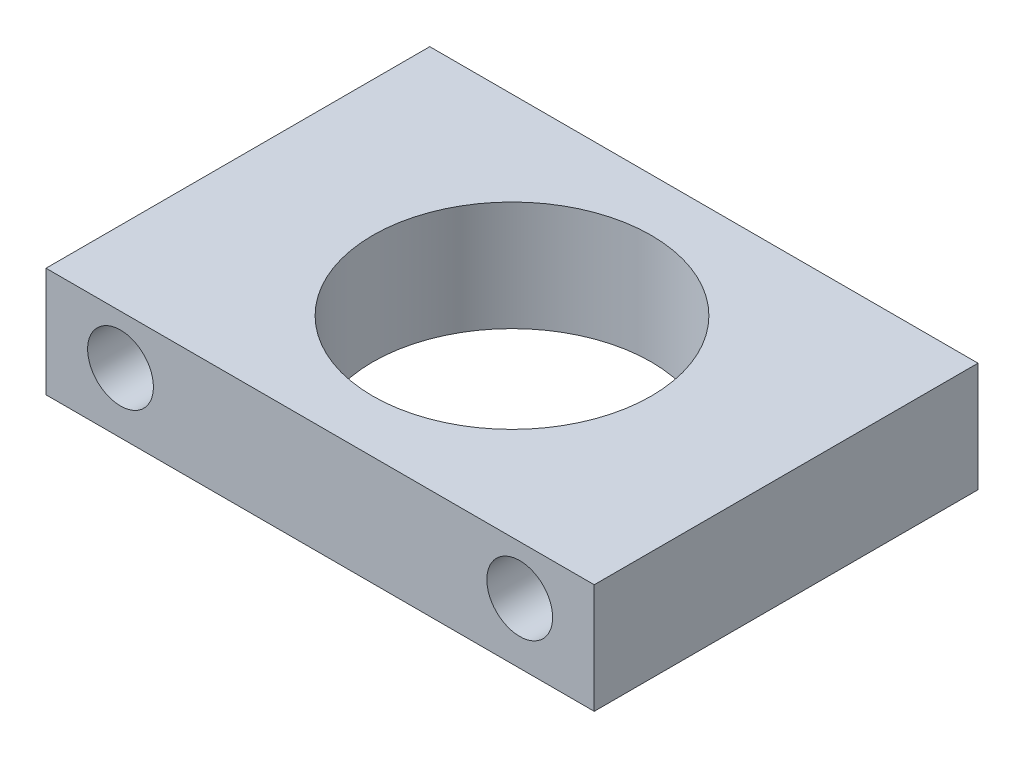
ISO-10303-21;
HEADER;
FILE_DESCRIPTION(('STEP AP214'),'2;1');
FILE_NAME('part.step','',(''),(''),'','','');
FILE_SCHEMA(('AUTOMOTIVE_DESIGN { 1 0 10303 214 1 1 1 1 }'));
ENDSEC;
DATA;
#1=APPLICATION_CONTEXT('core data for automotive mechanical design processes');
#2=APPLICATION_PROTOCOL_DEFINITION('international standard','automotive_design',2000,#1);
#3=PRODUCT_CONTEXT('',#1,'mechanical');
#4=PRODUCT('Part','Part','',(#3));
#5=PRODUCT_RELATED_PRODUCT_CATEGORY('part','',(#4));
#6=PRODUCT_DEFINITION_FORMATION('','',#4);
#7=PRODUCT_DEFINITION_CONTEXT('part definition',#1,'design');
#8=PRODUCT_DEFINITION('design','',#6,#7);
#9=PRODUCT_DEFINITION_SHAPE('','',#8);
#10=(LENGTH_UNIT() NAMED_UNIT(*) SI_UNIT(.MILLI.,.METRE.));
#11=(NAMED_UNIT(*) PLANE_ANGLE_UNIT() SI_UNIT($,.RADIAN.));
#12=(NAMED_UNIT(*) SI_UNIT($,.STERADIAN.) SOLID_ANGLE_UNIT());
#13=UNCERTAINTY_MEASURE_WITH_UNIT(LENGTH_MEASURE(1.E-05),#10,'distance_accuracy_value','');
#14=(GEOMETRIC_REPRESENTATION_CONTEXT(3) GLOBAL_UNCERTAINTY_ASSIGNED_CONTEXT((#13)) GLOBAL_UNIT_ASSIGNED_CONTEXT((#10,
#11,#12)) REPRESENTATION_CONTEXT('',''));
#15=CARTESIAN_POINT('',(0.,0.,0.));
#16=DIRECTION('',(0.,0.,1.));
#17=DIRECTION('',(1.,0.,0.));
#18=AXIS2_PLACEMENT_3D('',#15,#16,#17);
#19=CARTESIAN_POINT('',(0.,10.,0.));
#20=DIRECTION('',(0.,1.,0.));
#21=DIRECTION('',(0.,0.,1.));
#22=AXIS2_PLACEMENT_3D('',#19,#20,#21);
#23=PLANE('',#22);
#24=DIRECTION('',(0.,0.,-1.));
#25=VECTOR('',#24,1.);
#26=CARTESIAN_POINT('',(25.,10.,-17.5));
#27=LINE('',#26,#25);
#28=CARTESIAN_POINT('',(25.,10.,17.5));
#29=VERTEX_POINT('',#28);
#30=CARTESIAN_POINT('',(25.,10.,-17.5));
#31=VERTEX_POINT('',#30);
#32=EDGE_CURVE('E100',#29,#31,#27,.T.);
#33=ORIENTED_EDGE('',*,*,#32,.T.);
#34=DIRECTION('',(-1.,0.,0.));
#35=VECTOR('',#34,1.);
#36=CARTESIAN_POINT('',(-25.,10.,-17.5));
#37=LINE('',#36,#35);
#38=CARTESIAN_POINT('',(-25.,10.,-17.5));
#39=VERTEX_POINT('',#38);
#40=EDGE_CURVE('E95',#31,#39,#37,.T.);
#41=ORIENTED_EDGE('',*,*,#40,.T.);
#42=DIRECTION('',(0.,0.,1.));
#43=VECTOR('',#42,1.);
#44=CARTESIAN_POINT('',(-25.,10.,-17.5));
#45=LINE('',#44,#43);
#46=CARTESIAN_POINT('',(-25.,10.,17.5));
#47=VERTEX_POINT('',#46);
#48=EDGE_CURVE('E98',#39,#47,#45,.T.);
#49=ORIENTED_EDGE('',*,*,#48,.T.);
#50=DIRECTION('',(1.,0.,0.));
#51=VECTOR('',#50,1.);
#52=CARTESIAN_POINT('',(-25.,10.,17.5));
#53=LINE('',#52,#51);
#54=EDGE_CURVE('E59',#47,#29,#53,.T.);
#55=ORIENTED_EDGE('',*,*,#54,.T.);
#56=EDGE_LOOP('',(#33,#41,#49,#55));
#57=FACE_BOUND('',#56,.T.);
#58=CARTESIAN_POINT('',(0.,10.,0.));
#59=DIRECTION('',(0.,1.,0.));
#60=DIRECTION('',(0.,0.,1.));
#61=AXIS2_PLACEMENT_3D('',#58,#59,#60);
#62=CIRCLE('',#61,12.7);
#63=CARTESIAN_POINT('',(0.,10.,12.7));
#64=VERTEX_POINT('',#63);
#65=EDGE_CURVE('E121',#64,#64,#62,.T.);
#66=ORIENTED_EDGE('',*,*,#65,.F.);
#67=EDGE_LOOP('',(#66));
#68=FACE_BOUND('',#67,.T.);
#69=ADVANCED_FACE('F39',(#57,#68),#23,.T.);
#70=CARTESIAN_POINT('',(0.,0.,0.));
#71=DIRECTION('',(0.,1.,0.));
#72=DIRECTION('',(0.,0.,1.));
#73=AXIS2_PLACEMENT_3D('',#70,#71,#72);
#74=PLANE('',#73);
#75=DIRECTION('',(0.,0.,-1.));
#76=VECTOR('',#75,1.);
#77=CARTESIAN_POINT('',(25.,0.,-17.5));
#78=LINE('',#77,#76);
#79=CARTESIAN_POINT('',(25.,0.,17.5));
#80=VERTEX_POINT('',#79);
#81=CARTESIAN_POINT('',(25.,0.,-17.5));
#82=VERTEX_POINT('',#81);
#83=EDGE_CURVE('E117',#80,#82,#78,.T.);
#84=ORIENTED_EDGE('',*,*,#83,.F.);
#85=DIRECTION('',(1.,0.,0.));
#86=VECTOR('',#85,1.);
#87=CARTESIAN_POINT('',(-25.,0.,17.5));
#88=LINE('',#87,#86);
#89=CARTESIAN_POINT('',(-25.,0.,17.5));
#90=VERTEX_POINT('',#89);
#91=EDGE_CURVE('E87',#90,#80,#88,.T.);
#92=ORIENTED_EDGE('',*,*,#91,.F.);
#93=DIRECTION('',(0.,0.,1.));
#94=VECTOR('',#93,1.);
#95=CARTESIAN_POINT('',(-25.,0.,-17.5));
#96=LINE('',#95,#94);
#97=CARTESIAN_POINT('',(-25.,0.,-17.5));
#98=VERTEX_POINT('',#97);
#99=EDGE_CURVE('E79',#98,#90,#96,.T.);
#100=ORIENTED_EDGE('',*,*,#99,.F.);
#101=DIRECTION('',(-1.,0.,0.));
#102=VECTOR('',#101,1.);
#103=CARTESIAN_POINT('',(-25.,0.,-17.5));
#104=LINE('',#103,#102);
#105=EDGE_CURVE('E105',#82,#98,#104,.T.);
#106=ORIENTED_EDGE('',*,*,#105,.F.);
#107=EDGE_LOOP('',(#84,#92,#100,#106));
#108=FACE_BOUND('',#107,.T.);
#109=CARTESIAN_POINT('',(0.,0.,0.));
#110=DIRECTION('',(0.,1.,0.));
#111=DIRECTION('',(0.,0.,1.));
#112=AXIS2_PLACEMENT_3D('',#109,#110,#111);
#113=CIRCLE('',#112,12.7);
#114=CARTESIAN_POINT('',(0.,0.,12.7));
#115=VERTEX_POINT('',#114);
#116=EDGE_CURVE('E139',#115,#115,#113,.T.);
#117=ORIENTED_EDGE('',*,*,#116,.T.);
#118=EDGE_LOOP('',(#117));
#119=FACE_BOUND('',#118,.T.);
#120=ADVANCED_FACE('F134',(#108,#119),#74,.F.);
#121=CARTESIAN_POINT('',(25.,10.,-17.5));
#122=DIRECTION('',(-1.,0.,0.));
#123=DIRECTION('',(0.,0.,1.));
#124=AXIS2_PLACEMENT_3D('',#121,#122,#123);
#125=PLANE('',#124);
#126=ORIENTED_EDGE('',*,*,#83,.T.);
#127=DIRECTION('',(0.,-1.,0.));
#128=VECTOR('',#127,1.);
#129=CARTESIAN_POINT('',(25.,10.,-17.5));
#130=LINE('',#129,#128);
#131=EDGE_CURVE('E11',#31,#82,#130,.T.);
#132=ORIENTED_EDGE('',*,*,#131,.F.);
#133=ORIENTED_EDGE('',*,*,#32,.F.);
#134=DIRECTION('',(0.,-1.,0.));
#135=VECTOR('',#134,1.);
#136=CARTESIAN_POINT('',(25.,10.,17.5));
#137=LINE('',#136,#135);
#138=EDGE_CURVE('E113',#29,#80,#137,.T.);
#139=ORIENTED_EDGE('',*,*,#138,.T.);
#140=EDGE_LOOP('',(#126,#132,#133,#139));
#141=FACE_BOUND('',#140,.T.);
#142=ADVANCED_FACE('F41',(#141),#125,.F.);
#143=CARTESIAN_POINT('',(-25.,10.,-17.5));
#144=DIRECTION('',(0.,0.,1.));
#145=DIRECTION('',(1.,0.,0.));
#146=AXIS2_PLACEMENT_3D('',#143,#144,#145);
#147=PLANE('',#146);
#148=CARTESIAN_POINT('',(18.2034119603633,5.51588163823184,-17.5));
#149=DIRECTION('',(0.,0.,1.));
#150=DIRECTION('',(1.,0.,0.));
#151=AXIS2_PLACEMENT_3D('',#148,#149,#150);
#152=CIRCLE('',#151,3.);
#153=CARTESIAN_POINT('',(21.2034119603633,5.51588163823184,-17.5));
#154=VERTEX_POINT('',#153);
#155=EDGE_CURVE('E153',#154,#154,#152,.T.);
#156=ORIENTED_EDGE('',*,*,#155,.T.);
#157=EDGE_LOOP('',(#156));
#158=FACE_BOUND('',#157,.T.);
#159=CARTESIAN_POINT('',(-18.2034119603633,5.51588163823184,-17.5));
#160=DIRECTION('',(0.,0.,1.));
#161=DIRECTION('',(1.,0.,0.));
#162=AXIS2_PLACEMENT_3D('',#159,#160,#161);
#163=CIRCLE('',#162,3.);
#164=CARTESIAN_POINT('',(-15.2034119603633,5.51588163823184,-17.5));
#165=VERTEX_POINT('',#164);
#166=EDGE_CURVE('E143',#165,#165,#163,.T.);
#167=ORIENTED_EDGE('',*,*,#166,.T.);
#168=EDGE_LOOP('',(#167));
#169=FACE_BOUND('',#168,.T.);
#170=ORIENTED_EDGE('',*,*,#105,.T.);
#171=DIRECTION('',(0.,-1.,0.));
#172=VECTOR('',#171,1.);
#173=CARTESIAN_POINT('',(-25.,10.,-17.5));
#174=LINE('',#173,#172);
#175=EDGE_CURVE('E49',#39,#98,#174,.T.);
#176=ORIENTED_EDGE('',*,*,#175,.F.);
#177=ORIENTED_EDGE('',*,*,#40,.F.);
#178=ORIENTED_EDGE('',*,*,#131,.T.);
#179=EDGE_LOOP('',(#170,#176,#177,#178));
#180=FACE_BOUND('',#179,.T.);
#181=ADVANCED_FACE('F104',(#158,#169,#180),#147,.F.);
#182=CARTESIAN_POINT('',(-25.,10.,-17.5));
#183=DIRECTION('',(1.,0.,0.));
#184=DIRECTION('',(0.,0.,-1.));
#185=AXIS2_PLACEMENT_3D('',#182,#183,#184);
#186=PLANE('',#185);
#187=ORIENTED_EDGE('',*,*,#99,.T.);
#188=DIRECTION('',(0.,-1.,0.));
#189=VECTOR('',#188,1.);
#190=CARTESIAN_POINT('',(-25.,10.,17.5));
#191=LINE('',#190,#189);
#192=EDGE_CURVE('E107',#47,#90,#191,.T.);
#193=ORIENTED_EDGE('',*,*,#192,.F.);
#194=ORIENTED_EDGE('',*,*,#48,.F.);
#195=ORIENTED_EDGE('',*,*,#175,.T.);
#196=EDGE_LOOP('',(#187,#193,#194,#195));
#197=FACE_BOUND('',#196,.T.);
#198=ADVANCED_FACE('F108',(#197),#186,.F.);
#199=CARTESIAN_POINT('',(-25.,10.,17.5));
#200=DIRECTION('',(0.,0.,-1.));
#201=DIRECTION('',(-1.,0.,0.));
#202=AXIS2_PLACEMENT_3D('',#199,#200,#201);
#203=PLANE('',#202);
#204=CARTESIAN_POINT('',(18.2034119603633,5.51588163823184,17.5));
#205=DIRECTION('',(0.,0.,1.));
#206=DIRECTION('',(1.,0.,0.));
#207=AXIS2_PLACEMENT_3D('',#204,#205,#206);
#208=CIRCLE('',#207,3.);
#209=CARTESIAN_POINT('',(21.2034119603633,5.51588163823184,17.5));
#210=VERTEX_POINT('',#209);
#211=EDGE_CURVE('E157',#210,#210,#208,.T.);
#212=ORIENTED_EDGE('',*,*,#211,.F.);
#213=EDGE_LOOP('',(#212));
#214=FACE_BOUND('',#213,.T.);
#215=CARTESIAN_POINT('',(-18.2034119603633,5.51588163823184,17.5));
#216=DIRECTION('',(0.,0.,1.));
#217=DIRECTION('',(1.,0.,0.));
#218=AXIS2_PLACEMENT_3D('',#215,#216,#217);
#219=CIRCLE('',#218,3.);
#220=CARTESIAN_POINT('',(-15.2034119603633,5.51588163823184,17.5));
#221=VERTEX_POINT('',#220);
#222=EDGE_CURVE('E150',#221,#221,#219,.T.);
#223=ORIENTED_EDGE('',*,*,#222,.F.);
#224=EDGE_LOOP('',(#223));
#225=FACE_BOUND('',#224,.T.);
#226=ORIENTED_EDGE('',*,*,#91,.T.);
#227=ORIENTED_EDGE('',*,*,#138,.F.);
#228=ORIENTED_EDGE('',*,*,#54,.F.);
#229=ORIENTED_EDGE('',*,*,#192,.T.);
#230=EDGE_LOOP('',(#226,#227,#228,#229));
#231=FACE_BOUND('',#230,.T.);
#232=ADVANCED_FACE('F131',(#214,#225,#231),#203,.F.);
#233=CARTESIAN_POINT('',(0.,10.,0.));
#234=DIRECTION('',(0.,-1.,0.));
#235=DIRECTION('',(0.,0.,-1.));
#236=AXIS2_PLACEMENT_3D('',#233,#234,#235);
#237=CYLINDRICAL_SURFACE('',#236,12.7);
#238=ORIENTED_EDGE('',*,*,#65,.T.);
#239=EDGE_LOOP('',(#238));
#240=FACE_BOUND('',#239,.T.);
#241=ORIENTED_EDGE('',*,*,#116,.F.);
#242=EDGE_LOOP('',(#241));
#243=FACE_BOUND('',#242,.T.);
#244=ADVANCED_FACE('F167',(#240,#243),#237,.F.);
#245=CARTESIAN_POINT('',(-18.2034119603633,5.51588163823184,-44.5));
#246=DIRECTION('',(0.,0.,1.));
#247=DIRECTION('',(1.,0.,0.));
#248=AXIS2_PLACEMENT_3D('',#245,#246,#247);
#249=CYLINDRICAL_SURFACE('',#248,3.);
#250=ORIENTED_EDGE('',*,*,#222,.T.);
#251=EDGE_LOOP('',(#250));
#252=FACE_BOUND('',#251,.T.);
#253=ORIENTED_EDGE('',*,*,#166,.F.);
#254=EDGE_LOOP('',(#253));
#255=FACE_BOUND('',#254,.T.);
#256=ADVANCED_FACE('F171',(#252,#255),#249,.F.);
#257=CARTESIAN_POINT('',(18.2034119603633,5.51588163823184,-44.5));
#258=DIRECTION('',(0.,0.,1.));
#259=DIRECTION('',(1.,0.,0.));
#260=AXIS2_PLACEMENT_3D('',#257,#258,#259);
#261=CYLINDRICAL_SURFACE('',#260,3.);
#262=ORIENTED_EDGE('',*,*,#211,.T.);
#263=EDGE_LOOP('',(#262));
#264=FACE_BOUND('',#263,.T.);
#265=ORIENTED_EDGE('',*,*,#155,.F.);
#266=EDGE_LOOP('',(#265));
#267=FACE_BOUND('',#266,.T.);
#268=ADVANCED_FACE('F162',(#264,#267),#261,.F.);
#269=CLOSED_SHELL('',(#69,#120,#142,#181,#198,#232,#244,#256,#268));
#270=MANIFOLD_SOLID_BREP('B2',#269);
#271=ADVANCED_BREP_SHAPE_REPRESENTATION('',(#18,#270),#14);
#272=SHAPE_DEFINITION_REPRESENTATION(#9,#271);
ENDSEC;
END-ISO-10303-21;
